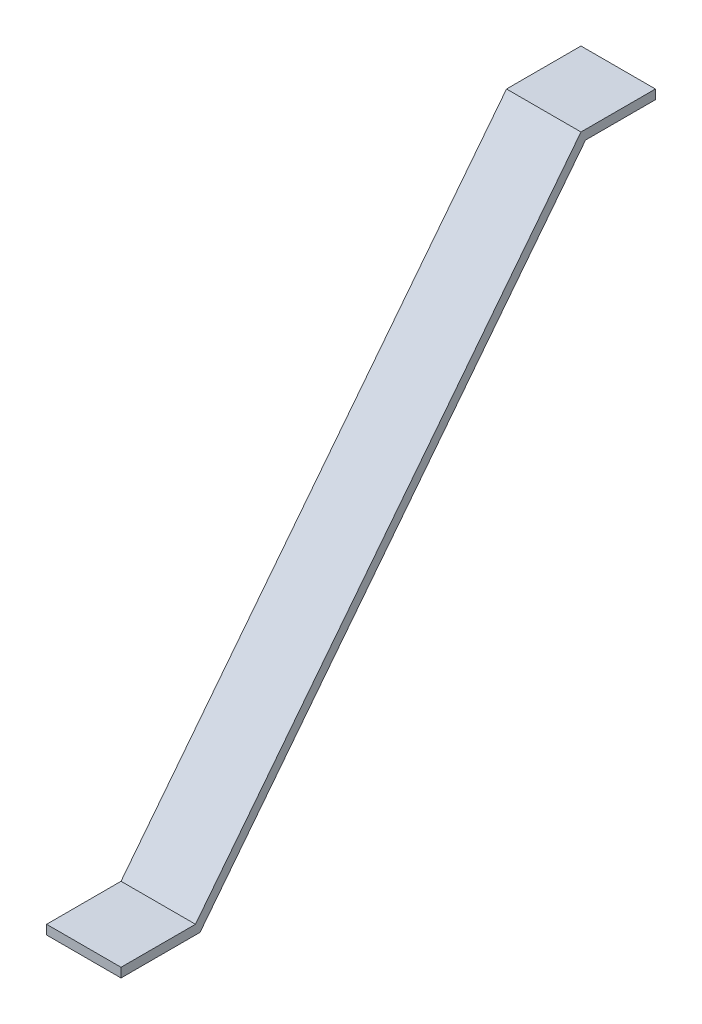
ISO-10303-21;
HEADER;
FILE_DESCRIPTION(('STEP AP214'),'2;1');
FILE_NAME('part.step','',(''),(''),'','','');
FILE_SCHEMA(('AUTOMOTIVE_DESIGN { 1 0 10303 214 1 1 1 1 }'));
ENDSEC;
DATA;
#1=APPLICATION_CONTEXT('core data for automotive mechanical design processes');
#2=APPLICATION_PROTOCOL_DEFINITION('international standard','automotive_design',2000,#1);
#3=PRODUCT_CONTEXT('',#1,'mechanical');
#4=PRODUCT('Part','Part','',(#3));
#5=PRODUCT_RELATED_PRODUCT_CATEGORY('part','',(#4));
#6=PRODUCT_DEFINITION_FORMATION('','',#4);
#7=PRODUCT_DEFINITION_CONTEXT('part definition',#1,'design');
#8=PRODUCT_DEFINITION('design','',#6,#7);
#9=PRODUCT_DEFINITION_SHAPE('','',#8);
#10=(LENGTH_UNIT() NAMED_UNIT(*) SI_UNIT(.MILLI.,.METRE.));
#11=(NAMED_UNIT(*) PLANE_ANGLE_UNIT() SI_UNIT($,.RADIAN.));
#12=(NAMED_UNIT(*) SI_UNIT($,.STERADIAN.) SOLID_ANGLE_UNIT());
#13=UNCERTAINTY_MEASURE_WITH_UNIT(LENGTH_MEASURE(1.E-05),#10,'distance_accuracy_value','');
#14=(GEOMETRIC_REPRESENTATION_CONTEXT(3) GLOBAL_UNCERTAINTY_ASSIGNED_CONTEXT((#13)) GLOBAL_UNIT_ASSIGNED_CONTEXT((#10,
#11,#12)) REPRESENTATION_CONTEXT('',''));
#15=CARTESIAN_POINT('',(0.,0.,0.));
#16=DIRECTION('',(0.,0.,1.));
#17=DIRECTION('',(1.,0.,0.));
#18=AXIS2_PLACEMENT_3D('',#15,#16,#17);
#19=CARTESIAN_POINT('',(25.4,-14.0399102095887,122.456620815539));
#20=DIRECTION('',(0.,0.,-1.));
#21=DIRECTION('',(-1.,0.,0.));
#22=AXIS2_PLACEMENT_3D('',#19,#20,#21);
#23=PLANE('',#22);
#24=DIRECTION('',(0.,-1.,0.));
#25=VECTOR('',#24,1.);
#26=CARTESIAN_POINT('',(0.,-14.0399102095887,122.456620815539));
#27=LINE('',#26,#25);
#28=CARTESIAN_POINT('',(0.,-14.0399102095887,122.456620815539));
#29=VERTEX_POINT('',#28);
#30=CARTESIAN_POINT('',(0.,-17.2149102095887,122.456620815539));
#31=VERTEX_POINT('',#30);
#32=EDGE_CURVE('E132',#29,#31,#27,.T.);
#33=ORIENTED_EDGE('',*,*,#32,.T.);
#34=DIRECTION('',(-1.,0.,0.));
#35=VECTOR('',#34,1.);
#36=CARTESIAN_POINT('',(25.4,-17.2149102095887,122.456620815539));
#37=LINE('',#36,#35);
#38=CARTESIAN_POINT('',(25.4,-17.2149102095887,122.456620815539));
#39=VERTEX_POINT('',#38);
#40=EDGE_CURVE('E11',#39,#31,#37,.T.);
#41=ORIENTED_EDGE('',*,*,#40,.F.);
#42=DIRECTION('',(0.,-1.,0.));
#43=VECTOR('',#42,1.);
#44=CARTESIAN_POINT('',(25.4,-14.0399102095887,122.456620815539));
#45=LINE('',#44,#43);
#46=CARTESIAN_POINT('',(25.4,-14.0399102095887,122.456620815539));
#47=VERTEX_POINT('',#46);
#48=EDGE_CURVE('E146',#47,#39,#45,.T.);
#49=ORIENTED_EDGE('',*,*,#48,.F.);
#50=DIRECTION('',(-1.,0.,0.));
#51=VECTOR('',#50,1.);
#52=CARTESIAN_POINT('',(25.4,-14.0399102095887,122.456620815539));
#53=LINE('',#52,#51);
#54=EDGE_CURVE('E128',#47,#29,#53,.T.);
#55=ORIENTED_EDGE('',*,*,#54,.T.);
#56=EDGE_LOOP('',(#33,#41,#49,#55));
#57=FACE_BOUND('',#56,.T.);
#58=ADVANCED_FACE('F36',(#57),#23,.F.);
#59=CARTESIAN_POINT('',(25.4,-17.2149102095887,122.456620815539));
#60=DIRECTION('',(0.,1.,0.));
#61=DIRECTION('',(0.,0.,1.));
#62=AXIS2_PLACEMENT_3D('',#59,#60,#61);
#63=PLANE('',#62);
#64=DIRECTION('',(0.,0.,-1.));
#65=VECTOR('',#64,1.);
#66=CARTESIAN_POINT('',(0.,-17.2149102095887,122.456620815539));
#67=LINE('',#66,#65);
#68=CARTESIAN_POINT('',(0.,-17.2149102095887,95.5080698468427));
#69=VERTEX_POINT('',#68);
#70=EDGE_CURVE('E135',#31,#69,#67,.T.);
#71=ORIENTED_EDGE('',*,*,#70,.T.);
#72=DIRECTION('',(-1.,0.,0.));
#73=VECTOR('',#72,1.);
#74=CARTESIAN_POINT('',(25.4,-17.2149102095887,95.5080698468427));
#75=LINE('',#74,#73);
#76=CARTESIAN_POINT('',(25.4,-17.2149102095887,95.5080698468427));
#77=VERTEX_POINT('',#76);
#78=EDGE_CURVE('E44',#77,#69,#75,.T.);
#79=ORIENTED_EDGE('',*,*,#78,.F.);
#80=DIRECTION('',(0.,0.,-1.));
#81=VECTOR('',#80,1.);
#82=CARTESIAN_POINT('',(25.4,-17.2149102095887,122.456620815539));
#83=LINE('',#82,#81);
#84=EDGE_CURVE('E95',#39,#77,#83,.T.);
#85=ORIENTED_EDGE('',*,*,#84,.F.);
#86=ORIENTED_EDGE('',*,*,#40,.T.);
#87=EDGE_LOOP('',(#71,#79,#85,#86));
#88=FACE_BOUND('',#87,.T.);
#89=ADVANCED_FACE('F181',(#88),#63,.F.);
#90=CARTESIAN_POINT('',(25.4,-17.2149102095887,95.5080698468427));
#91=DIRECTION('',(0.,0.615661475325656,0.788010753606723));
#92=DIRECTION('',(0.,-0.788010753606723,0.615661475325656));
#93=AXIS2_PLACEMENT_3D('',#90,#91,#92);
#94=PLANE('',#93);
#95=DIRECTION('',(0.,0.788010753606723,-0.615661475325656));
#96=VECTOR('',#95,1.);
#97=CARTESIAN_POINT('',(0.,-17.2149102095887,95.5080698468427));
#98=LINE('',#97,#96);
#99=CARTESIAN_POINT('',(0.,151.104186760807,-35.9972212827175));
#100=VERTEX_POINT('',#99);
#101=EDGE_CURVE('E137',#69,#100,#98,.T.);
#102=ORIENTED_EDGE('',*,*,#101,.T.);
#103=DIRECTION('',(-1.,0.,0.));
#104=VECTOR('',#103,1.);
#105=CARTESIAN_POINT('',(25.4,151.104186760807,-35.9972212827175));
#106=LINE('',#105,#104);
#107=CARTESIAN_POINT('',(25.4,151.104186760807,-35.9972212827175));
#108=VERTEX_POINT('',#107);
#109=EDGE_CURVE('E153',#108,#100,#106,.T.);
#110=ORIENTED_EDGE('',*,*,#109,.F.);
#111=DIRECTION('',(0.,0.788010753606723,-0.615661475325656));
#112=VECTOR('',#111,1.);
#113=CARTESIAN_POINT('',(25.4,-17.2149102095887,95.5080698468427));
#114=LINE('',#113,#112);
#115=EDGE_CURVE('E161',#77,#108,#114,.T.);
#116=ORIENTED_EDGE('',*,*,#115,.F.);
#117=ORIENTED_EDGE('',*,*,#78,.T.);
#118=EDGE_LOOP('',(#102,#110,#116,#117));
#119=FACE_BOUND('',#118,.T.);
#120=ADVANCED_FACE('F159',(#119),#94,.F.);
#121=CARTESIAN_POINT('',(25.4,151.104186760807,-35.9972212827175));
#122=DIRECTION('',(0.,1.,0.));
#123=DIRECTION('',(0.,0.,1.));
#124=AXIS2_PLACEMENT_3D('',#121,#122,#123);
#125=PLANE('',#124);
#126=DIRECTION('',(0.,0.,-1.));
#127=VECTOR('',#126,1.);
#128=CARTESIAN_POINT('',(0.,151.104186760807,-35.9972212827175));
#129=LINE('',#128,#127);
#130=CARTESIAN_POINT('',(0.,151.104186760807,-59.8486703140208));
#131=VERTEX_POINT('',#130);
#132=EDGE_CURVE('E139',#100,#131,#129,.T.);
#133=ORIENTED_EDGE('',*,*,#132,.T.);
#134=DIRECTION('',(-1.,0.,0.));
#135=VECTOR('',#134,1.);
#136=CARTESIAN_POINT('',(25.4,151.104186760807,-59.8486703140208));
#137=LINE('',#136,#135);
#138=CARTESIAN_POINT('',(25.4,151.104186760807,-59.8486703140208));
#139=VERTEX_POINT('',#138);
#140=EDGE_CURVE('E150',#139,#131,#137,.T.);
#141=ORIENTED_EDGE('',*,*,#140,.F.);
#142=DIRECTION('',(0.,0.,-1.));
#143=VECTOR('',#142,1.);
#144=CARTESIAN_POINT('',(25.4,151.104186760807,-35.9972212827175));
#145=LINE('',#144,#143);
#146=EDGE_CURVE('E173',#108,#139,#145,.T.);
#147=ORIENTED_EDGE('',*,*,#146,.F.);
#148=ORIENTED_EDGE('',*,*,#109,.T.);
#149=EDGE_LOOP('',(#133,#141,#147,#148));
#150=FACE_BOUND('',#149,.T.);
#151=ADVANCED_FACE('F169',(#150),#125,.F.);
#152=CARTESIAN_POINT('',(25.4,154.279186760807,-59.8486703140208));
#153=DIRECTION('',(0.,0.,1.));
#154=DIRECTION('',(1.,0.,0.));
#155=AXIS2_PLACEMENT_3D('',#152,#153,#154);
#156=PLANE('',#155);
#157=DIRECTION('',(0.,1.,0.));
#158=VECTOR('',#157,1.);
#159=CARTESIAN_POINT('',(0.,154.279186760807,-59.8486703140208));
#160=LINE('',#159,#158);
#161=CARTESIAN_POINT('',(0.,154.279186760807,-59.8486703140208));
#162=VERTEX_POINT('',#161);
#163=EDGE_CURVE('E141',#131,#162,#160,.T.);
#164=ORIENTED_EDGE('',*,*,#163,.T.);
#165=DIRECTION('',(-1.,0.,0.));
#166=VECTOR('',#165,1.);
#167=CARTESIAN_POINT('',(25.4,154.279186760807,-59.8486703140208));
#168=LINE('',#167,#166);
#169=CARTESIAN_POINT('',(25.4,154.279186760807,-59.8486703140208));
#170=VERTEX_POINT('',#169);
#171=EDGE_CURVE('E123',#170,#162,#168,.T.);
#172=ORIENTED_EDGE('',*,*,#171,.F.);
#173=DIRECTION('',(0.,1.,0.));
#174=VECTOR('',#173,1.);
#175=CARTESIAN_POINT('',(25.4,154.279186760807,-59.8486703140208));
#176=LINE('',#175,#174);
#177=EDGE_CURVE('E114',#139,#170,#176,.T.);
#178=ORIENTED_EDGE('',*,*,#177,.F.);
#179=ORIENTED_EDGE('',*,*,#140,.T.);
#180=EDGE_LOOP('',(#164,#172,#178,#179));
#181=FACE_BOUND('',#180,.T.);
#182=ADVANCED_FACE('F172',(#181),#156,.F.);
#183=CARTESIAN_POINT('',(25.4,154.279186760807,-34.4486703140208));
#184=DIRECTION('',(0.,-1.,0.));
#185=DIRECTION('',(0.,0.,-1.));
#186=AXIS2_PLACEMENT_3D('',#183,#184,#185);
#187=PLANE('',#186);
#188=DIRECTION('',(0.,0.,1.));
#189=VECTOR('',#188,1.);
#190=CARTESIAN_POINT('',(0.,154.279186760807,-34.4486703140208));
#191=LINE('',#190,#189);
#192=CARTESIAN_POINT('',(0.,154.279186760807,-34.4486703140208));
#193=VERTEX_POINT('',#192);
#194=EDGE_CURVE('E122',#162,#193,#191,.T.);
#195=ORIENTED_EDGE('',*,*,#194,.T.);
#196=DIRECTION('',(-1.,0.,0.));
#197=VECTOR('',#196,1.);
#198=CARTESIAN_POINT('',(25.4,154.279186760807,-34.4486703140208));
#199=LINE('',#198,#197);
#200=CARTESIAN_POINT('',(25.4,154.279186760807,-34.4486703140208));
#201=VERTEX_POINT('',#200);
#202=EDGE_CURVE('E119',#201,#193,#199,.T.);
#203=ORIENTED_EDGE('',*,*,#202,.F.);
#204=DIRECTION('',(0.,0.,1.));
#205=VECTOR('',#204,1.);
#206=CARTESIAN_POINT('',(25.4,154.279186760807,-34.4486703140208));
#207=LINE('',#206,#205);
#208=EDGE_CURVE('E108',#170,#201,#207,.T.);
#209=ORIENTED_EDGE('',*,*,#208,.F.);
#210=ORIENTED_EDGE('',*,*,#171,.T.);
#211=EDGE_LOOP('',(#195,#203,#209,#210));
#212=FACE_BOUND('',#211,.T.);
#213=ADVANCED_FACE('F120',(#212),#187,.F.);
#214=CARTESIAN_POINT('',(25.4,-14.0399102095887,97.0566208155393));
#215=DIRECTION('',(0.,-0.615661475325656,-0.788010753606723));
#216=DIRECTION('',(0.,0.788010753606723,-0.615661475325656));
#217=AXIS2_PLACEMENT_3D('',#214,#215,#216);
#218=PLANE('',#217);
#219=DIRECTION('',(0.,-0.788010753606723,0.615661475325656));
#220=VECTOR('',#219,1.);
#221=CARTESIAN_POINT('',(0.,-14.0399102095887,97.0566208155393));
#222=LINE('',#221,#220);
#223=CARTESIAN_POINT('',(0.,-14.0399102095887,97.0566208155393));
#224=VERTEX_POINT('',#223);
#225=EDGE_CURVE('E81',#193,#224,#222,.T.);
#226=ORIENTED_EDGE('',*,*,#225,.T.);
#227=DIRECTION('',(-1.,0.,0.));
#228=VECTOR('',#227,1.);
#229=CARTESIAN_POINT('',(25.4,-14.0399102095887,97.0566208155393));
#230=LINE('',#229,#228);
#231=CARTESIAN_POINT('',(25.4,-14.0399102095887,97.0566208155393));
#232=VERTEX_POINT('',#231);
#233=EDGE_CURVE('E124',#232,#224,#230,.T.);
#234=ORIENTED_EDGE('',*,*,#233,.F.);
#235=DIRECTION('',(0.,-0.788010753606723,0.615661475325656));
#236=VECTOR('',#235,1.);
#237=CARTESIAN_POINT('',(25.4,-14.0399102095887,97.0566208155393));
#238=LINE('',#237,#236);
#239=EDGE_CURVE('E112',#201,#232,#238,.T.);
#240=ORIENTED_EDGE('',*,*,#239,.F.);
#241=ORIENTED_EDGE('',*,*,#202,.T.);
#242=EDGE_LOOP('',(#226,#234,#240,#241));
#243=FACE_BOUND('',#242,.T.);
#244=ADVANCED_FACE('F126',(#243),#218,.F.);
#245=CARTESIAN_POINT('',(25.4,-14.0399102095887,122.456620815539));
#246=DIRECTION('',(0.,-1.,0.));
#247=DIRECTION('',(0.,0.,-1.));
#248=AXIS2_PLACEMENT_3D('',#245,#246,#247);
#249=PLANE('',#248);
#250=DIRECTION('',(0.,0.,1.));
#251=VECTOR('',#250,1.);
#252=CARTESIAN_POINT('',(0.,-14.0399102095887,122.456620815539));
#253=LINE('',#252,#251);
#254=EDGE_CURVE('E87',#224,#29,#253,.T.);
#255=ORIENTED_EDGE('',*,*,#254,.T.);
#256=ORIENTED_EDGE('',*,*,#54,.F.);
#257=DIRECTION('',(0.,0.,1.));
#258=VECTOR('',#257,1.);
#259=CARTESIAN_POINT('',(25.4,-14.0399102095887,122.456620815539));
#260=LINE('',#259,#258);
#261=EDGE_CURVE('E52',#232,#47,#260,.T.);
#262=ORIENTED_EDGE('',*,*,#261,.F.);
#263=ORIENTED_EDGE('',*,*,#233,.T.);
#264=EDGE_LOOP('',(#255,#256,#262,#263));
#265=FACE_BOUND('',#264,.T.);
#266=ADVANCED_FACE('F197',(#265),#249,.F.);
#267=CARTESIAN_POINT('',(25.4,0.,0.));
#268=DIRECTION('',(1.,0.,0.));
#269=DIRECTION('',(0.,0.,-1.));
#270=AXIS2_PLACEMENT_3D('',#267,#268,#269);
#271=PLANE('',#270);
#272=ORIENTED_EDGE('',*,*,#48,.T.);
#273=ORIENTED_EDGE('',*,*,#84,.T.);
#274=ORIENTED_EDGE('',*,*,#115,.T.);
#275=ORIENTED_EDGE('',*,*,#146,.T.);
#276=ORIENTED_EDGE('',*,*,#177,.T.);
#277=ORIENTED_EDGE('',*,*,#208,.T.);
#278=ORIENTED_EDGE('',*,*,#239,.T.);
#279=ORIENTED_EDGE('',*,*,#261,.T.);
#280=EDGE_LOOP('',(#272,#273,#274,#275,#276,#277,#278,#279));
#281=FACE_BOUND('',#280,.T.);
#282=ADVANCED_FACE('F110',(#281),#271,.T.);
#283=CARTESIAN_POINT('',(0.,0.,0.));
#284=DIRECTION('',(1.,0.,0.));
#285=DIRECTION('',(0.,0.,-1.));
#286=AXIS2_PLACEMENT_3D('',#283,#284,#285);
#287=PLANE('',#286);
#288=ORIENTED_EDGE('',*,*,#32,.F.);
#289=ORIENTED_EDGE('',*,*,#254,.F.);
#290=ORIENTED_EDGE('',*,*,#225,.F.);
#291=ORIENTED_EDGE('',*,*,#194,.F.);
#292=ORIENTED_EDGE('',*,*,#163,.F.);
#293=ORIENTED_EDGE('',*,*,#132,.F.);
#294=ORIENTED_EDGE('',*,*,#101,.F.);
#295=ORIENTED_EDGE('',*,*,#70,.F.);
#296=EDGE_LOOP('',(#288,#289,#290,#291,#292,#293,#294,#295));
#297=FACE_BOUND('',#296,.T.);
#298=ADVANCED_FACE('F165',(#297),#287,.F.);
#299=CLOSED_SHELL('',(#58,#89,#120,#151,#182,#213,#244,#266,#282,#298));
#300=MANIFOLD_SOLID_BREP('B2',#299);
#301=ADVANCED_BREP_SHAPE_REPRESENTATION('',(#18,#300),#14);
#302=SHAPE_DEFINITION_REPRESENTATION(#9,#301);
ENDSEC;
END-ISO-10303-21;
